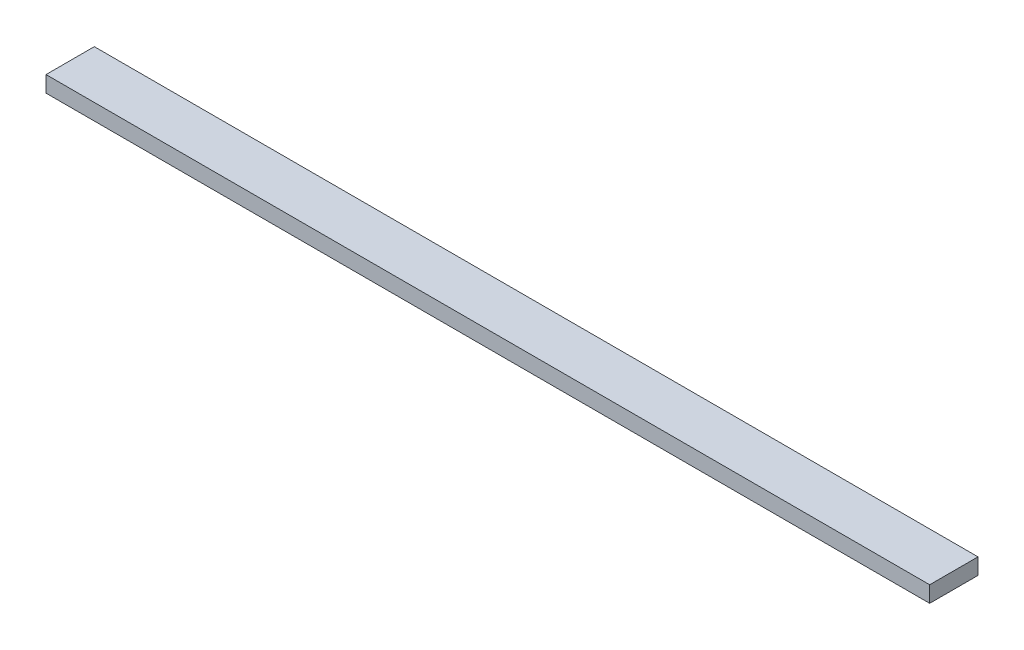
ISO-10303-21;
HEADER;
FILE_DESCRIPTION(('STEP AP214'),'2;1');
FILE_NAME('part.step','',(''),(''),'','','');
FILE_SCHEMA(('AUTOMOTIVE_DESIGN { 1 0 10303 214 1 1 1 1 }'));
ENDSEC;
DATA;
#1=APPLICATION_CONTEXT('core data for automotive mechanical design processes');
#2=APPLICATION_PROTOCOL_DEFINITION('international standard','automotive_design',2000,#1);
#3=PRODUCT_CONTEXT('',#1,'mechanical');
#4=PRODUCT('Part','Part','',(#3));
#5=PRODUCT_RELATED_PRODUCT_CATEGORY('part','',(#4));
#6=PRODUCT_DEFINITION_FORMATION('','',#4);
#7=PRODUCT_DEFINITION_CONTEXT('part definition',#1,'design');
#8=PRODUCT_DEFINITION('design','',#6,#7);
#9=PRODUCT_DEFINITION_SHAPE('','',#8);
#10=(LENGTH_UNIT() NAMED_UNIT(*) SI_UNIT(.MILLI.,.METRE.));
#11=(NAMED_UNIT(*) PLANE_ANGLE_UNIT() SI_UNIT($,.RADIAN.));
#12=(NAMED_UNIT(*) SI_UNIT($,.STERADIAN.) SOLID_ANGLE_UNIT());
#13=UNCERTAINTY_MEASURE_WITH_UNIT(LENGTH_MEASURE(1.E-05),#10,'distance_accuracy_value','');
#14=(GEOMETRIC_REPRESENTATION_CONTEXT(3) GLOBAL_UNCERTAINTY_ASSIGNED_CONTEXT((#13)) GLOBAL_UNIT_ASSIGNED_CONTEXT((#10,
#11,#12)) REPRESENTATION_CONTEXT('',''));
#15=CARTESIAN_POINT('',(0.,0.,0.));
#16=DIRECTION('',(0.,0.,1.));
#17=DIRECTION('',(1.,0.,0.));
#18=AXIS2_PLACEMENT_3D('',#15,#16,#17);
#19=CARTESIAN_POINT('',(-274.265,10.,-15.));
#20=DIRECTION('',(1.,0.,0.));
#21=DIRECTION('',(0.,0.,-1.));
#22=AXIS2_PLACEMENT_3D('',#19,#20,#21);
#23=PLANE('',#22);
#24=DIRECTION('',(0.,0.,1.));
#25=VECTOR('',#24,1.);
#26=CARTESIAN_POINT('',(-274.265,0.,-15.));
#27=LINE('',#26,#25);
#28=CARTESIAN_POINT('',(-274.265,0.,-15.));
#29=VERTEX_POINT('',#28);
#30=CARTESIAN_POINT('',(-274.265,0.,15.));
#31=VERTEX_POINT('',#30);
#32=EDGE_CURVE('E95',#29,#31,#27,.T.);
#33=ORIENTED_EDGE('',*,*,#32,.T.);
#34=DIRECTION('',(0.,-1.,0.));
#35=VECTOR('',#34,1.);
#36=CARTESIAN_POINT('',(-274.265,10.,15.));
#37=LINE('',#36,#35);
#38=CARTESIAN_POINT('',(-274.265,10.,15.));
#39=VERTEX_POINT('',#38);
#40=EDGE_CURVE('E11',#39,#31,#37,.T.);
#41=ORIENTED_EDGE('',*,*,#40,.F.);
#42=DIRECTION('',(0.,0.,1.));
#43=VECTOR('',#42,1.);
#44=CARTESIAN_POINT('',(-274.265,10.,-15.));
#45=LINE('',#44,#43);
#46=CARTESIAN_POINT('',(-274.265,10.,-15.));
#47=VERTEX_POINT('',#46);
#48=EDGE_CURVE('E83',#47,#39,#45,.T.);
#49=ORIENTED_EDGE('',*,*,#48,.F.);
#50=DIRECTION('',(0.,-1.,0.));
#51=VECTOR('',#50,1.);
#52=CARTESIAN_POINT('',(-274.265,10.,-15.));
#53=LINE('',#52,#51);
#54=EDGE_CURVE('E91',#47,#29,#53,.T.);
#55=ORIENTED_EDGE('',*,*,#54,.T.);
#56=EDGE_LOOP('',(#33,#41,#49,#55));
#57=FACE_BOUND('',#56,.T.);
#58=ADVANCED_FACE('F32',(#57),#23,.F.);
#59=CARTESIAN_POINT('',(-274.265,10.,15.));
#60=DIRECTION('',(0.,0.,-1.));
#61=DIRECTION('',(-1.,0.,0.));
#62=AXIS2_PLACEMENT_3D('',#59,#60,#61);
#63=PLANE('',#62);
#64=DIRECTION('',(1.,0.,0.));
#65=VECTOR('',#64,1.);
#66=CARTESIAN_POINT('',(-274.265,0.,15.));
#67=LINE('',#66,#65);
#68=CARTESIAN_POINT('',(274.265,0.,15.));
#69=VERTEX_POINT('',#68);
#70=EDGE_CURVE('E87',#31,#69,#67,.T.);
#71=ORIENTED_EDGE('',*,*,#70,.T.);
#72=DIRECTION('',(0.,-1.,0.));
#73=VECTOR('',#72,1.);
#74=CARTESIAN_POINT('',(274.265,10.,15.));
#75=LINE('',#74,#73);
#76=CARTESIAN_POINT('',(274.265,10.,15.));
#77=VERTEX_POINT('',#76);
#78=EDGE_CURVE('E40',#77,#69,#75,.T.);
#79=ORIENTED_EDGE('',*,*,#78,.F.);
#80=DIRECTION('',(1.,0.,0.));
#81=VECTOR('',#80,1.);
#82=CARTESIAN_POINT('',(-274.265,10.,15.));
#83=LINE('',#82,#81);
#84=EDGE_CURVE('E78',#39,#77,#83,.T.);
#85=ORIENTED_EDGE('',*,*,#84,.F.);
#86=ORIENTED_EDGE('',*,*,#40,.T.);
#87=EDGE_LOOP('',(#71,#79,#85,#86));
#88=FACE_BOUND('',#87,.T.);
#89=ADVANCED_FACE('F86',(#88),#63,.F.);
#90=CARTESIAN_POINT('',(274.265,10.,-15.));
#91=DIRECTION('',(-1.,0.,0.));
#92=DIRECTION('',(0.,0.,1.));
#93=AXIS2_PLACEMENT_3D('',#90,#91,#92);
#94=PLANE('',#93);
#95=DIRECTION('',(0.,0.,-1.));
#96=VECTOR('',#95,1.);
#97=CARTESIAN_POINT('',(274.265,0.,-15.));
#98=LINE('',#97,#96);
#99=CARTESIAN_POINT('',(274.265,0.,-15.));
#100=VERTEX_POINT('',#99);
#101=EDGE_CURVE('E65',#69,#100,#98,.T.);
#102=ORIENTED_EDGE('',*,*,#101,.T.);
#103=DIRECTION('',(0.,-1.,0.));
#104=VECTOR('',#103,1.);
#105=CARTESIAN_POINT('',(274.265,10.,-15.));
#106=LINE('',#105,#104);
#107=CARTESIAN_POINT('',(274.265,10.,-15.));
#108=VERTEX_POINT('',#107);
#109=EDGE_CURVE('E88',#108,#100,#106,.T.);
#110=ORIENTED_EDGE('',*,*,#109,.F.);
#111=DIRECTION('',(0.,0.,-1.));
#112=VECTOR('',#111,1.);
#113=CARTESIAN_POINT('',(274.265,10.,-15.));
#114=LINE('',#113,#112);
#115=EDGE_CURVE('E81',#77,#108,#114,.T.);
#116=ORIENTED_EDGE('',*,*,#115,.F.);
#117=ORIENTED_EDGE('',*,*,#78,.T.);
#118=EDGE_LOOP('',(#102,#110,#116,#117));
#119=FACE_BOUND('',#118,.T.);
#120=ADVANCED_FACE('F89',(#119),#94,.F.);
#121=CARTESIAN_POINT('',(-274.265,10.,-15.));
#122=DIRECTION('',(0.,0.,1.));
#123=DIRECTION('',(1.,0.,0.));
#124=AXIS2_PLACEMENT_3D('',#121,#122,#123);
#125=PLANE('',#124);
#126=DIRECTION('',(-1.,0.,0.));
#127=VECTOR('',#126,1.);
#128=CARTESIAN_POINT('',(-274.265,0.,-15.));
#129=LINE('',#128,#127);
#130=EDGE_CURVE('E71',#100,#29,#129,.T.);
#131=ORIENTED_EDGE('',*,*,#130,.T.);
#132=ORIENTED_EDGE('',*,*,#54,.F.);
#133=DIRECTION('',(-1.,0.,0.));
#134=VECTOR('',#133,1.);
#135=CARTESIAN_POINT('',(-274.265,10.,-15.));
#136=LINE('',#135,#134);
#137=EDGE_CURVE('E48',#108,#47,#136,.T.);
#138=ORIENTED_EDGE('',*,*,#137,.F.);
#139=ORIENTED_EDGE('',*,*,#109,.T.);
#140=EDGE_LOOP('',(#131,#132,#138,#139));
#141=FACE_BOUND('',#140,.T.);
#142=ADVANCED_FACE('F102',(#141),#125,.F.);
#143=CARTESIAN_POINT('',(0.,10.,0.));
#144=DIRECTION('',(0.,1.,0.));
#145=DIRECTION('',(0.,0.,1.));
#146=AXIS2_PLACEMENT_3D('',#143,#144,#145);
#147=PLANE('',#146);
#148=ORIENTED_EDGE('',*,*,#48,.T.);
#149=ORIENTED_EDGE('',*,*,#84,.T.);
#150=ORIENTED_EDGE('',*,*,#115,.T.);
#151=ORIENTED_EDGE('',*,*,#137,.T.);
#152=EDGE_LOOP('',(#148,#149,#150,#151));
#153=FACE_BOUND('',#152,.T.);
#154=ADVANCED_FACE('F79',(#153),#147,.T.);
#155=CARTESIAN_POINT('',(0.,0.,0.));
#156=DIRECTION('',(0.,1.,0.));
#157=DIRECTION('',(0.,0.,1.));
#158=AXIS2_PLACEMENT_3D('',#155,#156,#157);
#159=PLANE('',#158);
#160=ORIENTED_EDGE('',*,*,#32,.F.);
#161=ORIENTED_EDGE('',*,*,#130,.F.);
#162=ORIENTED_EDGE('',*,*,#101,.F.);
#163=ORIENTED_EDGE('',*,*,#70,.F.);
#164=EDGE_LOOP('',(#160,#161,#162,#163));
#165=FACE_BOUND('',#164,.T.);
#166=ADVANCED_FACE('F105',(#165),#159,.F.);
#167=CLOSED_SHELL('',(#58,#89,#120,#142,#154,#166));
#168=MANIFOLD_SOLID_BREP('B2',#167);
#169=ADVANCED_BREP_SHAPE_REPRESENTATION('',(#18,#168),#14);
#170=SHAPE_DEFINITION_REPRESENTATION(#9,#169);
ENDSEC;
END-ISO-10303-21;
